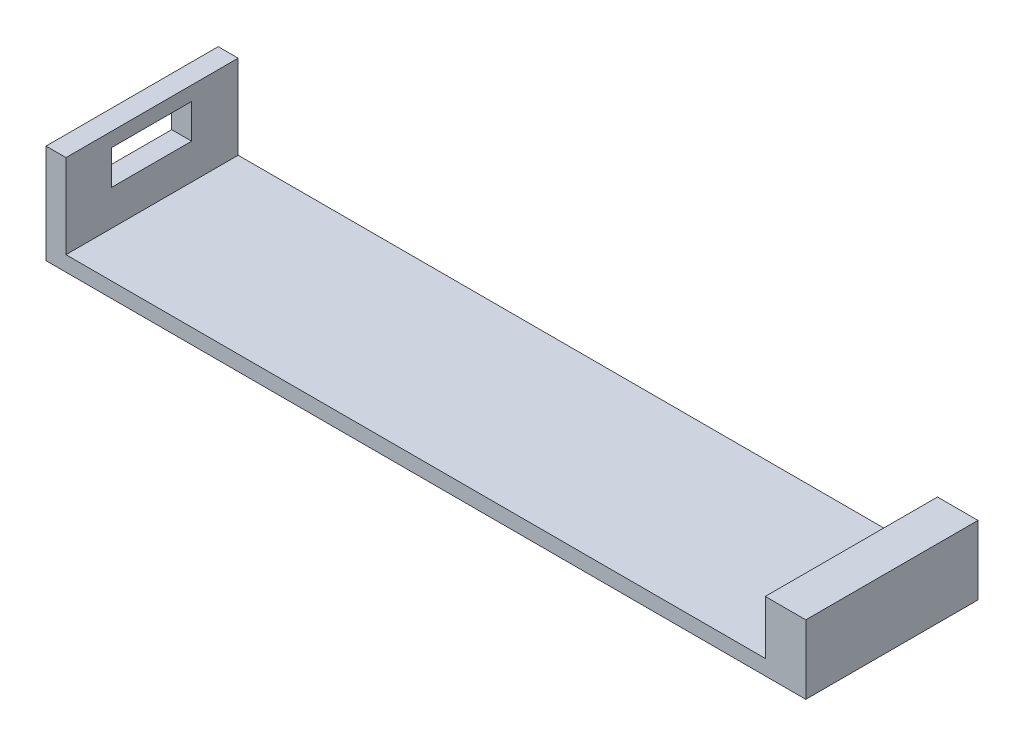
ISO-10303-21;
HEADER;
FILE_DESCRIPTION(('STEP AP214'),'2;1');
FILE_NAME('part.step','',(''),(''),'','','');
FILE_SCHEMA(('AUTOMOTIVE_DESIGN { 1 0 10303 214 1 1 1 1 }'));
ENDSEC;
DATA;
#1=APPLICATION_CONTEXT('core data for automotive mechanical design processes');
#2=APPLICATION_PROTOCOL_DEFINITION('international standard','automotive_design',2000,#1);
#3=PRODUCT_CONTEXT('',#1,'mechanical');
#4=PRODUCT('Part','Part','',(#3));
#5=PRODUCT_RELATED_PRODUCT_CATEGORY('part','',(#4));
#6=PRODUCT_DEFINITION_FORMATION('','',#4);
#7=PRODUCT_DEFINITION_CONTEXT('part definition',#1,'design');
#8=PRODUCT_DEFINITION('design','',#6,#7);
#9=PRODUCT_DEFINITION_SHAPE('','',#8);
#10=(LENGTH_UNIT() NAMED_UNIT(*) SI_UNIT(.MILLI.,.METRE.));
#11=(NAMED_UNIT(*) PLANE_ANGLE_UNIT() SI_UNIT($,.RADIAN.));
#12=(NAMED_UNIT(*) SI_UNIT($,.STERADIAN.) SOLID_ANGLE_UNIT());
#13=UNCERTAINTY_MEASURE_WITH_UNIT(LENGTH_MEASURE(1.E-05),#10,'distance_accuracy_value','');
#14=(GEOMETRIC_REPRESENTATION_CONTEXT(3) GLOBAL_UNCERTAINTY_ASSIGNED_CONTEXT((#13)) GLOBAL_UNIT_ASSIGNED_CONTEXT((#10,
#11,#12)) REPRESENTATION_CONTEXT('',''));
#15=CARTESIAN_POINT('',(0.,0.,0.));
#16=DIRECTION('',(0.,0.,1.));
#17=DIRECTION('',(1.,0.,0.));
#18=AXIS2_PLACEMENT_3D('',#15,#16,#17);
#19=CARTESIAN_POINT('',(0.,1.5,0.));
#20=DIRECTION('',(0.,1.,0.));
#21=DIRECTION('',(0.,0.,1.));
#22=AXIS2_PLACEMENT_3D('',#19,#20,#21);
#23=PLANE('',#22);
#24=DIRECTION('',(-1.,0.,0.));
#25=VECTOR('',#24,1.);
#26=CARTESIAN_POINT('',(-41.0507428233132,1.5,-0.513130140011073));
#27=LINE('',#26,#25);
#28=CARTESIAN_POINT('',(29.9492571766868,1.5,-0.513130140011073));
#29=VERTEX_POINT('',#28);
#30=CARTESIAN_POINT('',(-39.0814095867427,1.5,-0.513130140011073));
#31=VERTEX_POINT('',#30);
#32=EDGE_CURVE('E259',#29,#31,#27,.T.);
#33=ORIENTED_EDGE('',*,*,#32,.T.);
#34=DIRECTION('',(0.,0.,-1.));
#35=VECTOR('',#34,1.);
#36=CARTESIAN_POINT('',(-39.0814095867427,1.5,-0.513130140011073));
#37=LINE('',#36,#35);
#38=CARTESIAN_POINT('',(-39.0814095867427,1.5,16.4868698599889));
#39=VERTEX_POINT('',#38);
#40=EDGE_CURVE('E226',#39,#31,#37,.T.);
#41=ORIENTED_EDGE('',*,*,#40,.F.);
#42=DIRECTION('',(1.,0.,0.));
#43=VECTOR('',#42,1.);
#44=CARTESIAN_POINT('',(-41.0507428233132,1.5,16.4868698599889));
#45=LINE('',#44,#43);
#46=CARTESIAN_POINT('',(29.9492571766868,1.5,16.4868698599889));
#47=VERTEX_POINT('',#46);
#48=EDGE_CURVE('E39',#39,#47,#45,.T.);
#49=ORIENTED_EDGE('',*,*,#48,.T.);
#50=DIRECTION('',(0.,0.,1.));
#51=VECTOR('',#50,1.);
#52=CARTESIAN_POINT('',(29.9492571766868,1.5,-0.513130140011073));
#53=LINE('',#52,#51);
#54=EDGE_CURVE('E239',#29,#47,#53,.T.);
#55=ORIENTED_EDGE('',*,*,#54,.F.);
#56=EDGE_LOOP('',(#33,#41,#49,#55));
#57=FACE_BOUND('',#56,.T.);
#58=ADVANCED_FACE('F35',(#57),#23,.T.);
#59=CARTESIAN_POINT('',(-41.0507428233132,1.5,-0.513130140011073));
#60=DIRECTION('',(1.,0.,0.));
#61=DIRECTION('',(0.,0.,-1.));
#62=AXIS2_PLACEMENT_3D('',#59,#60,#61);
#63=PLANE('',#62);
#64=DIRECTION('',(0.,1.,0.));
#65=VECTOR('',#64,1.);
#66=CARTESIAN_POINT('',(-41.0507428233132,1.5,4.08076576542271));
#67=LINE('',#66,#65);
#68=CARTESIAN_POINT('',(-41.0507428233132,5.,4.08076576542271));
#69=VERTEX_POINT('',#68);
#70=CARTESIAN_POINT('',(-41.0507428233132,8.4,4.08076576542271));
#71=VERTEX_POINT('',#70);
#72=EDGE_CURVE('E182',#69,#71,#67,.T.);
#73=ORIENTED_EDGE('',*,*,#72,.T.);
#74=DIRECTION('',(0.,0.,1.));
#75=VECTOR('',#74,1.);
#76=CARTESIAN_POINT('',(-41.0507428233132,8.4,-0.513130140011071));
#77=LINE('',#76,#75);
#78=CARTESIAN_POINT('',(-41.0507428233132,8.4,11.9868698599889));
#79=VERTEX_POINT('',#78);
#80=EDGE_CURVE('E185',#71,#79,#77,.T.);
#81=ORIENTED_EDGE('',*,*,#80,.T.);
#82=DIRECTION('',(0.,-1.,0.));
#83=VECTOR('',#82,1.);
#84=CARTESIAN_POINT('',(-41.0507428233132,1.49999999999999,11.9868698599889));
#85=LINE('',#84,#83);
#86=CARTESIAN_POINT('',(-41.0507428233132,5.,11.9868698599889));
#87=VERTEX_POINT('',#86);
#88=EDGE_CURVE('E177',#79,#87,#85,.T.);
#89=ORIENTED_EDGE('',*,*,#88,.T.);
#90=DIRECTION('',(0.,0.,-1.));
#91=VECTOR('',#90,1.);
#92=CARTESIAN_POINT('',(-41.0507428233132,5.,-0.513130140011072));
#93=LINE('',#92,#91);
#94=EDGE_CURVE('E157',#87,#69,#93,.T.);
#95=ORIENTED_EDGE('',*,*,#94,.T.);
#96=EDGE_LOOP('',(#73,#81,#89,#95));
#97=FACE_BOUND('',#96,.T.);
#98=DIRECTION('',(0.,0.,1.));
#99=VECTOR('',#98,1.);
#100=CARTESIAN_POINT('',(-41.0507428233132,0.,-0.513130140011073));
#101=LINE('',#100,#99);
#102=CARTESIAN_POINT('',(-41.0507428233132,0.,-0.513130140011073));
#103=VERTEX_POINT('',#102);
#104=CARTESIAN_POINT('',(-41.0507428233132,0.,16.4868698599889));
#105=VERTEX_POINT('',#104);
#106=EDGE_CURVE('E266',#103,#105,#101,.T.);
#107=ORIENTED_EDGE('',*,*,#106,.T.);
#108=DIRECTION('',(0.,-1.,0.));
#109=VECTOR('',#108,1.);
#110=CARTESIAN_POINT('',(-41.0507428233132,1.5,16.4868698599889));
#111=LINE('',#110,#109);
#112=CARTESIAN_POINT('',(-41.0507428233132,9.8,16.4868698599889));
#113=VERTEX_POINT('',#112);
#114=EDGE_CURVE('E11',#113,#105,#111,.T.);
#115=ORIENTED_EDGE('',*,*,#114,.F.);
#116=DIRECTION('',(0.,0.,1.));
#117=VECTOR('',#116,1.);
#118=CARTESIAN_POINT('',(-41.0507428233132,9.8,-0.513130140011073));
#119=LINE('',#118,#117);
#120=CARTESIAN_POINT('',(-41.0507428233132,9.8,-0.513130140011073));
#121=VERTEX_POINT('',#120);
#122=EDGE_CURVE('E188',#121,#113,#119,.T.);
#123=ORIENTED_EDGE('',*,*,#122,.F.);
#124=DIRECTION('',(0.,-1.,0.));
#125=VECTOR('',#124,1.);
#126=CARTESIAN_POINT('',(-41.0507428233132,1.5,-0.513130140011073));
#127=LINE('',#126,#125);
#128=EDGE_CURVE('E283',#121,#103,#127,.T.);
#129=ORIENTED_EDGE('',*,*,#128,.T.);
#130=EDGE_LOOP('',(#107,#115,#123,#129));
#131=FACE_BOUND('',#130,.T.);
#132=ADVANCED_FACE('F37',(#97,#131),#63,.F.);
#133=CARTESIAN_POINT('',(-41.0507428233132,1.5,16.4868698599889));
#134=DIRECTION('',(0.,0.,-1.));
#135=DIRECTION('',(-1.,0.,0.));
#136=AXIS2_PLACEMENT_3D('',#133,#134,#135);
#137=PLANE('',#136);
#138=DIRECTION('',(1.,0.,0.));
#139=VECTOR('',#138,1.);
#140=CARTESIAN_POINT('',(-41.0507428233132,0.,16.4868698599889));
#141=LINE('',#140,#139);
#142=CARTESIAN_POINT('',(33.9492571766868,0.,16.4868698599889));
#143=VERTEX_POINT('',#142);
#144=EDGE_CURVE('E271',#105,#143,#141,.T.);
#145=ORIENTED_EDGE('',*,*,#144,.T.);
#146=DIRECTION('',(0.,-1.,0.));
#147=VECTOR('',#146,1.);
#148=CARTESIAN_POINT('',(33.9492571766868,1.5,16.4868698599889));
#149=LINE('',#148,#147);
#150=CARTESIAN_POINT('',(33.9492571766868,6.8,16.4868698599889));
#151=VERTEX_POINT('',#150);
#152=EDGE_CURVE('E45',#151,#143,#149,.T.);
#153=ORIENTED_EDGE('',*,*,#152,.F.);
#154=DIRECTION('',(1.,0.,0.));
#155=VECTOR('',#154,1.);
#156=CARTESIAN_POINT('',(29.9492571766868,6.8,16.4868698599889));
#157=LINE('',#156,#155);
#158=CARTESIAN_POINT('',(29.9492571766868,6.8,16.4868698599889));
#159=VERTEX_POINT('',#158);
#160=EDGE_CURVE('E245',#159,#151,#157,.T.);
#161=ORIENTED_EDGE('',*,*,#160,.F.);
#162=DIRECTION('',(0.,-1.,0.));
#163=VECTOR('',#162,1.);
#164=CARTESIAN_POINT('',(29.9492571766868,6.8,16.4868698599889));
#165=LINE('',#164,#163);
#166=EDGE_CURVE('E251',#159,#47,#165,.T.);
#167=ORIENTED_EDGE('',*,*,#166,.T.);
#168=ORIENTED_EDGE('',*,*,#48,.F.);
#169=DIRECTION('',(0.,-1.,0.));
#170=VECTOR('',#169,1.);
#171=CARTESIAN_POINT('',(-39.0814095867427,6.8,16.4868698599889));
#172=LINE('',#171,#170);
#173=CARTESIAN_POINT('',(-39.0814095867427,9.8,16.4868698599889));
#174=VERTEX_POINT('',#173);
#175=EDGE_CURVE('E237',#174,#39,#172,.T.);
#176=ORIENTED_EDGE('',*,*,#175,.F.);
#177=DIRECTION('',(1.,0.,0.));
#178=VECTOR('',#177,1.);
#179=CARTESIAN_POINT('',(-41.0507428233132,9.8,16.4868698599889));
#180=LINE('',#179,#178);
#181=EDGE_CURVE('E191',#113,#174,#180,.T.);
#182=ORIENTED_EDGE('',*,*,#181,.F.);
#183=ORIENTED_EDGE('',*,*,#114,.T.);
#184=EDGE_LOOP('',(#145,#153,#161,#167,#168,#176,#182,#183));
#185=FACE_BOUND('',#184,.T.);
#186=ADVANCED_FACE('F314',(#185),#137,.F.);
#187=CARTESIAN_POINT('',(33.9492571766868,1.5,-0.513130140011073));
#188=DIRECTION('',(-1.,0.,0.));
#189=DIRECTION('',(0.,0.,1.));
#190=AXIS2_PLACEMENT_3D('',#187,#188,#189);
#191=PLANE('',#190);
#192=DIRECTION('',(0.,0.,-1.));
#193=VECTOR('',#192,1.);
#194=CARTESIAN_POINT('',(33.9492571766868,0.,-0.513130140011073));
#195=LINE('',#194,#193);
#196=CARTESIAN_POINT('',(33.9492571766868,0.,-0.513130140011073));
#197=VERTEX_POINT('',#196);
#198=EDGE_CURVE('E276',#143,#197,#195,.T.);
#199=ORIENTED_EDGE('',*,*,#198,.T.);
#200=DIRECTION('',(0.,-1.,0.));
#201=VECTOR('',#200,1.);
#202=CARTESIAN_POINT('',(33.9492571766868,1.5,-0.513130140011073));
#203=LINE('',#202,#201);
#204=CARTESIAN_POINT('',(33.9492571766868,6.8,-0.513130140011073));
#205=VERTEX_POINT('',#204);
#206=EDGE_CURVE('E285',#205,#197,#203,.T.);
#207=ORIENTED_EDGE('',*,*,#206,.F.);
#208=DIRECTION('',(0.,0.,-1.));
#209=VECTOR('',#208,1.);
#210=CARTESIAN_POINT('',(33.9492571766868,6.8,16.4868698599889));
#211=LINE('',#210,#209);
#212=EDGE_CURVE('E248',#151,#205,#211,.T.);
#213=ORIENTED_EDGE('',*,*,#212,.F.);
#214=ORIENTED_EDGE('',*,*,#152,.T.);
#215=EDGE_LOOP('',(#199,#207,#213,#214));
#216=FACE_BOUND('',#215,.T.);
#217=ADVANCED_FACE('F292',(#216),#191,.F.);
#218=CARTESIAN_POINT('',(-41.0507428233132,1.5,-0.513130140011073));
#219=DIRECTION('',(0.,0.,1.));
#220=DIRECTION('',(1.,0.,0.));
#221=AXIS2_PLACEMENT_3D('',#218,#219,#220);
#222=PLANE('',#221);
#223=DIRECTION('',(-1.,0.,0.));
#224=VECTOR('',#223,1.);
#225=CARTESIAN_POINT('',(-41.0507428233132,0.,-0.513130140011073));
#226=LINE('',#225,#224);
#227=EDGE_CURVE('E281',#197,#103,#226,.T.);
#228=ORIENTED_EDGE('',*,*,#227,.T.);
#229=ORIENTED_EDGE('',*,*,#128,.F.);
#230=DIRECTION('',(-1.,0.,0.));
#231=VECTOR('',#230,1.);
#232=CARTESIAN_POINT('',(-41.0507428233132,9.8,-0.513130140011073));
#233=LINE('',#232,#231);
#234=CARTESIAN_POINT('',(-39.0814095867427,9.8,-0.513130140011073));
#235=VERTEX_POINT('',#234);
#236=EDGE_CURVE('E197',#235,#121,#233,.T.);
#237=ORIENTED_EDGE('',*,*,#236,.F.);
#238=DIRECTION('',(0.,-1.,0.));
#239=VECTOR('',#238,1.);
#240=CARTESIAN_POINT('',(-39.0814095867427,6.8,-0.513130140011073));
#241=LINE('',#240,#239);
#242=EDGE_CURVE('E234',#235,#31,#241,.T.);
#243=ORIENTED_EDGE('',*,*,#242,.T.);
#244=ORIENTED_EDGE('',*,*,#32,.F.);
#245=DIRECTION('',(0.,-1.,0.));
#246=VECTOR('',#245,1.);
#247=CARTESIAN_POINT('',(29.9492571766868,6.8,-0.513130140011073));
#248=LINE('',#247,#246);
#249=CARTESIAN_POINT('',(29.9492571766868,6.8,-0.513130140011073));
#250=VERTEX_POINT('',#249);
#251=EDGE_CURVE('E262',#250,#29,#248,.T.);
#252=ORIENTED_EDGE('',*,*,#251,.F.);
#253=DIRECTION('',(-1.,0.,0.));
#254=VECTOR('',#253,1.);
#255=CARTESIAN_POINT('',(33.9492571766868,6.8,-0.513130140011073));
#256=LINE('',#255,#254);
#257=EDGE_CURVE('E240',#205,#250,#256,.T.);
#258=ORIENTED_EDGE('',*,*,#257,.F.);
#259=ORIENTED_EDGE('',*,*,#206,.T.);
#260=EDGE_LOOP('',(#228,#229,#237,#243,#244,#252,#258,#259));
#261=FACE_BOUND('',#260,.T.);
#262=ADVANCED_FACE('F299',(#261),#222,.F.);
#263=CARTESIAN_POINT('',(0.,0.,0.));
#264=DIRECTION('',(0.,1.,0.));
#265=DIRECTION('',(0.,0.,1.));
#266=AXIS2_PLACEMENT_3D('',#263,#264,#265);
#267=PLANE('',#266);
#268=ORIENTED_EDGE('',*,*,#106,.F.);
#269=ORIENTED_EDGE('',*,*,#227,.F.);
#270=ORIENTED_EDGE('',*,*,#198,.F.);
#271=ORIENTED_EDGE('',*,*,#144,.F.);
#272=EDGE_LOOP('',(#268,#269,#270,#271));
#273=FACE_BOUND('',#272,.T.);
#274=ADVANCED_FACE('F297',(#273),#267,.F.);
#275=CARTESIAN_POINT('',(29.9492571766868,6.8,-0.513130140011073));
#276=DIRECTION('',(1.,0.,0.));
#277=DIRECTION('',(0.,0.,-1.));
#278=AXIS2_PLACEMENT_3D('',#275,#276,#277);
#279=PLANE('',#278);
#280=DIRECTION('',(0.,-1.,0.));
#281=VECTOR('',#280,1.);
#282=CARTESIAN_POINT('',(29.9492571766868,4.8,0.986869859988927));
#283=LINE('',#282,#281);
#284=CARTESIAN_POINT('',(29.9492571766868,4.8,0.986869859988927));
#285=VERTEX_POINT('',#284);
#286=CARTESIAN_POINT('',(29.9492571766868,3.5,0.986869859988927));
#287=VERTEX_POINT('',#286);
#288=EDGE_CURVE('E216',#285,#287,#283,.T.);
#289=ORIENTED_EDGE('',*,*,#288,.F.);
#290=DIRECTION('',(0.,0.,-1.));
#291=VECTOR('',#290,1.);
#292=CARTESIAN_POINT('',(29.9492571766868,4.8,0.986869859988927));
#293=LINE('',#292,#291);
#294=CARTESIAN_POINT('',(29.9492571766868,4.8,15.0428888146621));
#295=VERTEX_POINT('',#294);
#296=EDGE_CURVE('E200',#295,#285,#293,.T.);
#297=ORIENTED_EDGE('',*,*,#296,.F.);
#298=DIRECTION('',(0.,1.,0.));
#299=VECTOR('',#298,1.);
#300=CARTESIAN_POINT('',(29.9492571766868,4.8,15.0428888146621));
#301=LINE('',#300,#299);
#302=CARTESIAN_POINT('',(29.9492571766868,3.5,15.0428888146621));
#303=VERTEX_POINT('',#302);
#304=EDGE_CURVE('E205',#303,#295,#301,.T.);
#305=ORIENTED_EDGE('',*,*,#304,.F.);
#306=DIRECTION('',(0.,0.,1.));
#307=VECTOR('',#306,1.);
#308=CARTESIAN_POINT('',(29.9492571766868,3.5,0.986869859988927));
#309=LINE('',#308,#307);
#310=EDGE_CURVE('E219',#287,#303,#309,.T.);
#311=ORIENTED_EDGE('',*,*,#310,.F.);
#312=EDGE_LOOP('',(#289,#297,#305,#311));
#313=FACE_BOUND('',#312,.T.);
#314=ORIENTED_EDGE('',*,*,#54,.T.);
#315=ORIENTED_EDGE('',*,*,#166,.F.);
#316=DIRECTION('',(0.,0.,1.));
#317=VECTOR('',#316,1.);
#318=CARTESIAN_POINT('',(29.9492571766868,6.8,-0.513130140011073));
#319=LINE('',#318,#317);
#320=EDGE_CURVE('E243',#250,#159,#319,.T.);
#321=ORIENTED_EDGE('',*,*,#320,.F.);
#322=ORIENTED_EDGE('',*,*,#251,.T.);
#323=EDGE_LOOP('',(#314,#315,#321,#322));
#324=FACE_BOUND('',#323,.T.);
#325=ADVANCED_FACE('F313',(#313,#324),#279,.F.);
#326=CARTESIAN_POINT('',(0.,6.8,0.));
#327=DIRECTION('',(0.,1.,0.));
#328=DIRECTION('',(0.,0.,1.));
#329=AXIS2_PLACEMENT_3D('',#326,#327,#328);
#330=PLANE('',#329);
#331=ORIENTED_EDGE('',*,*,#257,.T.);
#332=ORIENTED_EDGE('',*,*,#320,.T.);
#333=ORIENTED_EDGE('',*,*,#160,.T.);
#334=ORIENTED_EDGE('',*,*,#212,.T.);
#335=EDGE_LOOP('',(#331,#332,#333,#334));
#336=FACE_BOUND('',#335,.T.);
#337=ADVANCED_FACE('F316',(#336),#330,.T.);
#338=CARTESIAN_POINT('',(-39.0814095867427,6.8,-0.513130140011073));
#339=DIRECTION('',(-1.,0.,0.));
#340=DIRECTION('',(0.,0.,1.));
#341=AXIS2_PLACEMENT_3D('',#338,#339,#340);
#342=PLANE('',#341);
#343=DIRECTION('',(0.,-1.,0.));
#344=VECTOR('',#343,1.);
#345=CARTESIAN_POINT('',(-39.0814095867427,8.4,11.9868698599889));
#346=LINE('',#345,#344);
#347=CARTESIAN_POINT('',(-39.0814095867427,8.4,11.9868698599889));
#348=VERTEX_POINT('',#347);
#349=CARTESIAN_POINT('',(-39.0814095867427,5.,11.9868698599889));
#350=VERTEX_POINT('',#349);
#351=EDGE_CURVE('E163',#348,#350,#346,.T.);
#352=ORIENTED_EDGE('',*,*,#351,.F.);
#353=DIRECTION('',(0.,0.,1.));
#354=VECTOR('',#353,1.);
#355=CARTESIAN_POINT('',(-39.0814095867427,8.4,11.9868698599889));
#356=LINE('',#355,#354);
#357=CARTESIAN_POINT('',(-39.0814095867427,8.4,4.08076576542271));
#358=VERTEX_POINT('',#357);
#359=EDGE_CURVE('E61',#358,#348,#356,.T.);
#360=ORIENTED_EDGE('',*,*,#359,.F.);
#361=DIRECTION('',(0.,1.,0.));
#362=VECTOR('',#361,1.);
#363=CARTESIAN_POINT('',(-39.0814095867427,8.4,4.08076576542271));
#364=LINE('',#363,#362);
#365=CARTESIAN_POINT('',(-39.0814095867427,5.,4.08076576542271));
#366=VERTEX_POINT('',#365);
#367=EDGE_CURVE('E170',#366,#358,#364,.T.);
#368=ORIENTED_EDGE('',*,*,#367,.F.);
#369=DIRECTION('',(0.,0.,-1.));
#370=VECTOR('',#369,1.);
#371=CARTESIAN_POINT('',(-39.0814095867427,5.,11.9868698599889));
#372=LINE('',#371,#370);
#373=EDGE_CURVE('E154',#350,#366,#372,.T.);
#374=ORIENTED_EDGE('',*,*,#373,.F.);
#375=EDGE_LOOP('',(#352,#360,#368,#374));
#376=FACE_BOUND('',#375,.T.);
#377=ORIENTED_EDGE('',*,*,#40,.T.);
#378=ORIENTED_EDGE('',*,*,#242,.F.);
#379=DIRECTION('',(0.,0.,-1.));
#380=VECTOR('',#379,1.);
#381=CARTESIAN_POINT('',(-39.0814095867427,9.8,-0.513130140011073));
#382=LINE('',#381,#380);
#383=EDGE_CURVE('E194',#174,#235,#382,.T.);
#384=ORIENTED_EDGE('',*,*,#383,.F.);
#385=ORIENTED_EDGE('',*,*,#175,.T.);
#386=EDGE_LOOP('',(#377,#378,#384,#385));
#387=FACE_BOUND('',#386,.T.);
#388=ADVANCED_FACE('F167',(#376,#387),#342,.F.);
#389=CARTESIAN_POINT('',(32.0492571766868,4.8,0.986869859988927));
#390=DIRECTION('',(0.,1.,0.));
#391=DIRECTION('',(0.,0.,1.));
#392=AXIS2_PLACEMENT_3D('',#389,#390,#391);
#393=PLANE('',#392);
#394=ORIENTED_EDGE('',*,*,#296,.T.);
#395=DIRECTION('',(-1.,0.,0.));
#396=VECTOR('',#395,1.);
#397=CARTESIAN_POINT('',(32.0492571766868,4.8,0.986869859988927));
#398=LINE('',#397,#396);
#399=CARTESIAN_POINT('',(32.0492571766868,4.8,0.986869859988927));
#400=VERTEX_POINT('',#399);
#401=EDGE_CURVE('E214',#400,#285,#398,.T.);
#402=ORIENTED_EDGE('',*,*,#401,.F.);
#403=DIRECTION('',(0.,0.,-1.));
#404=VECTOR('',#403,1.);
#405=CARTESIAN_POINT('',(32.0492571766868,4.8,0.986869859988927));
#406=LINE('',#405,#404);
#407=CARTESIAN_POINT('',(32.0492571766868,4.8,15.0428888146621));
#408=VERTEX_POINT('',#407);
#409=EDGE_CURVE('E201',#408,#400,#406,.T.);
#410=ORIENTED_EDGE('',*,*,#409,.F.);
#411=DIRECTION('',(-1.,0.,0.));
#412=VECTOR('',#411,1.);
#413=CARTESIAN_POINT('',(32.0492571766868,4.8,15.0428888146621));
#414=LINE('',#413,#412);
#415=EDGE_CURVE('E224',#408,#295,#414,.T.);
#416=ORIENTED_EDGE('',*,*,#415,.T.);
#417=EDGE_LOOP('',(#394,#402,#410,#416));
#418=FACE_BOUND('',#417,.T.);
#419=ADVANCED_FACE('F323',(#418),#393,.F.);
#420=CARTESIAN_POINT('',(32.0492571766868,4.8,15.0428888146621));
#421=DIRECTION('',(0.,0.,1.));
#422=DIRECTION('',(1.,0.,0.));
#423=AXIS2_PLACEMENT_3D('',#420,#421,#422);
#424=PLANE('',#423);
#425=ORIENTED_EDGE('',*,*,#304,.T.);
#426=ORIENTED_EDGE('',*,*,#415,.F.);
#427=DIRECTION('',(0.,1.,0.));
#428=VECTOR('',#427,1.);
#429=CARTESIAN_POINT('',(32.0492571766868,4.8,15.0428888146621));
#430=LINE('',#429,#428);
#431=CARTESIAN_POINT('',(32.0492571766868,3.5,15.0428888146621));
#432=VERTEX_POINT('',#431);
#433=EDGE_CURVE('E211',#432,#408,#430,.T.);
#434=ORIENTED_EDGE('',*,*,#433,.F.);
#435=DIRECTION('',(-1.,0.,0.));
#436=VECTOR('',#435,1.);
#437=CARTESIAN_POINT('',(32.0492571766868,3.5,15.0428888146621));
#438=LINE('',#437,#436);
#439=EDGE_CURVE('E227',#432,#303,#438,.T.);
#440=ORIENTED_EDGE('',*,*,#439,.T.);
#441=EDGE_LOOP('',(#425,#426,#434,#440));
#442=FACE_BOUND('',#441,.T.);
#443=ADVANCED_FACE('F374',(#442),#424,.F.);
#444=CARTESIAN_POINT('',(32.0492571766868,3.5,0.986869859988927));
#445=DIRECTION('',(0.,-1.,0.));
#446=DIRECTION('',(0.,0.,-1.));
#447=AXIS2_PLACEMENT_3D('',#444,#445,#446);
#448=PLANE('',#447);
#449=ORIENTED_EDGE('',*,*,#310,.T.);
#450=ORIENTED_EDGE('',*,*,#439,.F.);
#451=DIRECTION('',(0.,0.,1.));
#452=VECTOR('',#451,1.);
#453=CARTESIAN_POINT('',(32.0492571766868,3.5,0.986869859988927));
#454=LINE('',#453,#452);
#455=CARTESIAN_POINT('',(32.0492571766868,3.5,0.986869859988927));
#456=VERTEX_POINT('',#455);
#457=EDGE_CURVE('E208',#456,#432,#454,.T.);
#458=ORIENTED_EDGE('',*,*,#457,.F.);
#459=DIRECTION('',(-1.,0.,0.));
#460=VECTOR('',#459,1.);
#461=CARTESIAN_POINT('',(32.0492571766868,3.5,0.986869859988927));
#462=LINE('',#461,#460);
#463=EDGE_CURVE('E229',#456,#287,#462,.T.);
#464=ORIENTED_EDGE('',*,*,#463,.T.);
#465=EDGE_LOOP('',(#449,#450,#458,#464));
#466=FACE_BOUND('',#465,.T.);
#467=ADVANCED_FACE('F385',(#466),#448,.F.);
#468=CARTESIAN_POINT('',(32.0492571766868,4.8,0.986869859988927));
#469=DIRECTION('',(0.,0.,-1.));
#470=DIRECTION('',(-1.,0.,0.));
#471=AXIS2_PLACEMENT_3D('',#468,#469,#470);
#472=PLANE('',#471);
#473=ORIENTED_EDGE('',*,*,#288,.T.);
#474=ORIENTED_EDGE('',*,*,#463,.F.);
#475=DIRECTION('',(0.,-1.,0.));
#476=VECTOR('',#475,1.);
#477=CARTESIAN_POINT('',(32.0492571766868,4.8,0.986869859988927));
#478=LINE('',#477,#476);
#479=EDGE_CURVE('E204',#400,#456,#478,.T.);
#480=ORIENTED_EDGE('',*,*,#479,.F.);
#481=ORIENTED_EDGE('',*,*,#401,.T.);
#482=EDGE_LOOP('',(#473,#474,#480,#481));
#483=FACE_BOUND('',#482,.T.);
#484=ADVANCED_FACE('F395',(#483),#472,.F.);
#485=CARTESIAN_POINT('',(32.0492571766868,0.,0.));
#486=DIRECTION('',(1.,0.,0.));
#487=DIRECTION('',(0.,0.,-1.));
#488=AXIS2_PLACEMENT_3D('',#485,#486,#487);
#489=PLANE('',#488);
#490=ORIENTED_EDGE('',*,*,#409,.T.);
#491=ORIENTED_EDGE('',*,*,#479,.T.);
#492=ORIENTED_EDGE('',*,*,#457,.T.);
#493=ORIENTED_EDGE('',*,*,#433,.T.);
#494=EDGE_LOOP('',(#490,#491,#492,#493));
#495=FACE_BOUND('',#494,.T.);
#496=ADVANCED_FACE('F404',(#495),#489,.F.);
#497=CARTESIAN_POINT('',(0.,9.8,0.));
#498=DIRECTION('',(0.,1.,0.));
#499=DIRECTION('',(0.,0.,1.));
#500=AXIS2_PLACEMENT_3D('',#497,#498,#499);
#501=PLANE('',#500);
#502=ORIENTED_EDGE('',*,*,#122,.T.);
#503=ORIENTED_EDGE('',*,*,#181,.T.);
#504=ORIENTED_EDGE('',*,*,#383,.T.);
#505=ORIENTED_EDGE('',*,*,#236,.T.);
#506=EDGE_LOOP('',(#502,#503,#504,#505));
#507=FACE_BOUND('',#506,.T.);
#508=ADVANCED_FACE('F305',(#507),#501,.T.);
#509=CARTESIAN_POINT('',(-72.0814095867427,8.4,11.9868698599889));
#510=DIRECTION('',(0.,1.,0.));
#511=DIRECTION('',(0.,0.,1.));
#512=AXIS2_PLACEMENT_3D('',#509,#510,#511);
#513=PLANE('',#512);
#514=DIRECTION('',(1.,0.,0.));
#515=VECTOR('',#514,1.);
#516=CARTESIAN_POINT('',(-72.0814095867427,8.4,4.08076576542271));
#517=LINE('',#516,#515);
#518=EDGE_CURVE('E175',#71,#358,#517,.T.);
#519=ORIENTED_EDGE('',*,*,#518,.T.);
#520=ORIENTED_EDGE('',*,*,#359,.T.);
#521=DIRECTION('',(1.,0.,0.));
#522=VECTOR('',#521,1.);
#523=CARTESIAN_POINT('',(-72.0814095867427,8.4,11.9868698599889));
#524=LINE('',#523,#522);
#525=EDGE_CURVE('E160',#79,#348,#524,.T.);
#526=ORIENTED_EDGE('',*,*,#525,.F.);
#527=ORIENTED_EDGE('',*,*,#80,.F.);
#528=EDGE_LOOP('',(#519,#520,#526,#527));
#529=FACE_BOUND('',#528,.T.);
#530=ADVANCED_FACE('F422',(#529),#513,.F.);
#531=CARTESIAN_POINT('',(-72.0814095867427,8.4,4.08076576542271));
#532=DIRECTION('',(0.,0.,-1.));
#533=DIRECTION('',(-1.,0.,0.));
#534=AXIS2_PLACEMENT_3D('',#531,#532,#533);
#535=PLANE('',#534);
#536=DIRECTION('',(1.,0.,0.));
#537=VECTOR('',#536,1.);
#538=CARTESIAN_POINT('',(-72.0814095867427,5.,4.08076576542271));
#539=LINE('',#538,#537);
#540=EDGE_CURVE('E159',#69,#366,#539,.T.);
#541=ORIENTED_EDGE('',*,*,#540,.T.);
#542=ORIENTED_EDGE('',*,*,#367,.T.);
#543=ORIENTED_EDGE('',*,*,#518,.F.);
#544=ORIENTED_EDGE('',*,*,#72,.F.);
#545=EDGE_LOOP('',(#541,#542,#543,#544));
#546=FACE_BOUND('',#545,.T.);
#547=ADVANCED_FACE('F429',(#546),#535,.F.);
#548=CARTESIAN_POINT('',(-72.0814095867427,5.,11.9868698599889));
#549=DIRECTION('',(0.,-1.,0.));
#550=DIRECTION('',(0.,0.,-1.));
#551=AXIS2_PLACEMENT_3D('',#548,#549,#550);
#552=PLANE('',#551);
#553=DIRECTION('',(1.,0.,0.));
#554=VECTOR('',#553,1.);
#555=CARTESIAN_POINT('',(-72.0814095867427,5.,11.9868698599889));
#556=LINE('',#555,#554);
#557=EDGE_CURVE('E53',#87,#350,#556,.T.);
#558=ORIENTED_EDGE('',*,*,#557,.T.);
#559=ORIENTED_EDGE('',*,*,#373,.T.);
#560=ORIENTED_EDGE('',*,*,#540,.F.);
#561=ORIENTED_EDGE('',*,*,#94,.F.);
#562=EDGE_LOOP('',(#558,#559,#560,#561));
#563=FACE_BOUND('',#562,.T.);
#564=ADVANCED_FACE('F151',(#563),#552,.F.);
#565=CARTESIAN_POINT('',(-72.0814095867427,8.4,11.9868698599889));
#566=DIRECTION('',(0.,0.,1.));
#567=DIRECTION('',(0.,-1.,0.));
#568=AXIS2_PLACEMENT_3D('',#565,#566,#567);
#569=PLANE('',#568);
#570=ORIENTED_EDGE('',*,*,#525,.T.);
#571=ORIENTED_EDGE('',*,*,#351,.T.);
#572=ORIENTED_EDGE('',*,*,#557,.F.);
#573=ORIENTED_EDGE('',*,*,#88,.F.);
#574=EDGE_LOOP('',(#570,#571,#572,#573));
#575=FACE_BOUND('',#574,.T.);
#576=ADVANCED_FACE('F164',(#575),#569,.F.);
#577=CLOSED_SHELL('',(#58,#132,#186,#217,#262,#274,#325,#337,#388,#419,#443,#467,#484,#496,#508,
#530,#547,#564,#576));
#578=MANIFOLD_SOLID_BREP('B2',#577);
#579=ADVANCED_BREP_SHAPE_REPRESENTATION('',(#18,#578),#14);
#580=SHAPE_DEFINITION_REPRESENTATION(#9,#579);
ENDSEC;
END-ISO-10303-21;
